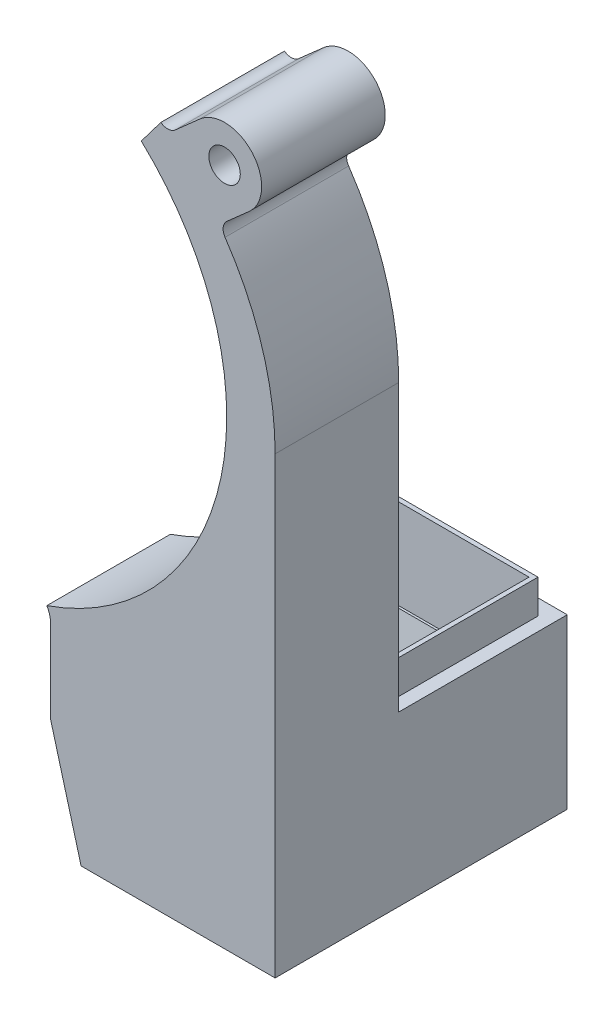
ISO-10303-21;
HEADER;
FILE_DESCRIPTION(('STEP AP214'),'2;1');
FILE_NAME('part.step','',(''),(''),'','','');
FILE_SCHEMA(('AUTOMOTIVE_DESIGN { 1 0 10303 214 1 1 1 1 }'));
ENDSEC;
DATA;
#1=APPLICATION_CONTEXT('core data for automotive mechanical design processes');
#2=APPLICATION_PROTOCOL_DEFINITION('international standard','automotive_design',2000,#1);
#3=PRODUCT_CONTEXT('',#1,'mechanical');
#4=PRODUCT('Part','Part','',(#3));
#5=PRODUCT_RELATED_PRODUCT_CATEGORY('part','',(#4));
#6=PRODUCT_DEFINITION_FORMATION('','',#4);
#7=PRODUCT_DEFINITION_CONTEXT('part definition',#1,'design');
#8=PRODUCT_DEFINITION('design','',#6,#7);
#9=PRODUCT_DEFINITION_SHAPE('','',#8);
#10=(LENGTH_UNIT() NAMED_UNIT(*) SI_UNIT(.MILLI.,.METRE.));
#11=(NAMED_UNIT(*) PLANE_ANGLE_UNIT() SI_UNIT($,.RADIAN.));
#12=(NAMED_UNIT(*) SI_UNIT($,.STERADIAN.) SOLID_ANGLE_UNIT());
#13=UNCERTAINTY_MEASURE_WITH_UNIT(LENGTH_MEASURE(1.E-05),#10,'distance_accuracy_value','');
#14=(GEOMETRIC_REPRESENTATION_CONTEXT(3) GLOBAL_UNCERTAINTY_ASSIGNED_CONTEXT((#13)) GLOBAL_UNIT_ASSIGNED_CONTEXT((#10,
#11,#12)) REPRESENTATION_CONTEXT('',''));
#15=CARTESIAN_POINT('',(0.,0.,0.));
#16=DIRECTION('',(0.,0.,1.));
#17=DIRECTION('',(1.,0.,0.));
#18=AXIS2_PLACEMENT_3D('',#15,#16,#17);
#19=CARTESIAN_POINT('',(2.21102133020147E-13,-22.4,0.));
#20=DIRECTION('',(0.,-1.,0.));
#21=DIRECTION('',(1.,0.,0.));
#22=AXIS2_PLACEMENT_3D('',#19,#20,#21);
#23=PLANE('',#22);
#24=DIRECTION('',(-1.,0.,0.));
#25=VECTOR('',#24,1.);
#26=CARTESIAN_POINT('',(2.22465130032725E-13,-22.4,-13.1999999999975));
#27=LINE('',#26,#25);
#28=CARTESIAN_POINT('',(25.9000000525163,-22.3999999999997,-13.1999999999975));
#29=VERTEX_POINT('',#28);
#30=CARTESIAN_POINT('',(9.09999999999595,-22.3999999999999,-13.1999999999975));
#31=VERTEX_POINT('',#30);
#32=EDGE_CURVE('E269',#29,#31,#27,.T.);
#33=ORIENTED_EDGE('',*,*,#32,.F.);
#34=DIRECTION('',(0.,0.,1.));
#35=VECTOR('',#34,1.);
#36=CARTESIAN_POINT('',(25.9000000525163,-22.3999999999997,0.));
#37=LINE('',#36,#35);
#38=CARTESIAN_POINT('',(25.9000000525163,-22.3999999999997,-1.50000000000016));
#39=VERTEX_POINT('',#38);
#40=EDGE_CURVE('E282',#29,#39,#37,.T.);
#41=ORIENTED_EDGE('',*,*,#40,.T.);
#42=DIRECTION('',(-1.,0.,0.));
#43=VECTOR('',#42,1.);
#44=CARTESIAN_POINT('',(2.21276379797324E-13,-22.4,-1.50000000000016));
#45=LINE('',#44,#43);
#46=CARTESIAN_POINT('',(9.09999999999595,-22.3999999999999,-1.50000000000016));
#47=VERTEX_POINT('',#46);
#48=EDGE_CURVE('E279',#39,#47,#45,.T.);
#49=ORIENTED_EDGE('',*,*,#48,.T.);
#50=DIRECTION('',(0.,0.,1.));
#51=VECTOR('',#50,1.);
#52=CARTESIAN_POINT('',(9.09999999999595,-22.3999999999999,0.));
#53=LINE('',#52,#51);
#54=EDGE_CURVE('E276',#31,#47,#53,.T.);
#55=ORIENTED_EDGE('',*,*,#54,.F.);
#56=EDGE_LOOP('',(#33,#41,#49,#55));
#57=FACE_BOUND('',#56,.T.);
#58=DIRECTION('',(0.,0.,-1.));
#59=VECTOR('',#58,1.);
#60=CARTESIAN_POINT('',(8.69999999999595,-22.3999999999999,0.));
#61=LINE('',#60,#59);
#62=CARTESIAN_POINT('',(8.69999999999595,-22.3999999999998,-1.10000000000016));
#63=VERTEX_POINT('',#62);
#64=CARTESIAN_POINT('',(8.69999999999588,-22.3999999999999,-13.5999999999975));
#65=VERTEX_POINT('',#64);
#66=EDGE_CURVE('E68',#63,#65,#61,.T.);
#67=ORIENTED_EDGE('',*,*,#66,.F.);
#68=DIRECTION('',(-1.,0.,0.));
#69=VECTOR('',#68,1.);
#70=CARTESIAN_POINT('',(2.21102133020147E-13,-22.4,-1.10000000000016));
#71=LINE('',#70,#69);
#72=CARTESIAN_POINT('',(26.3000000525163,-22.3999999999997,-1.10000000000016));
#73=VERTEX_POINT('',#72);
#74=EDGE_CURVE('E410',#73,#63,#71,.T.);
#75=ORIENTED_EDGE('',*,*,#74,.F.);
#76=DIRECTION('',(0.,0.,-1.));
#77=VECTOR('',#76,1.);
#78=CARTESIAN_POINT('',(26.3000000525163,-22.3999999999997,0.));
#79=LINE('',#78,#77);
#80=CARTESIAN_POINT('',(26.3000000525163,-22.3999999999998,-13.5999999999975));
#81=VERTEX_POINT('',#80);
#82=EDGE_CURVE('E407',#73,#81,#79,.T.);
#83=ORIENTED_EDGE('',*,*,#82,.T.);
#84=DIRECTION('',(-1.,0.,0.));
#85=VECTOR('',#84,1.);
#86=CARTESIAN_POINT('',(2.21102133020147E-13,-22.4,-13.5999999999975));
#87=LINE('',#86,#85);
#88=EDGE_CURVE('E404',#81,#65,#87,.T.);
#89=ORIENTED_EDGE('',*,*,#88,.T.);
#90=EDGE_LOOP('',(#67,#75,#83,#89));
#91=FACE_BOUND('',#90,.T.);
#92=ADVANCED_FACE('F60',(#57,#91),#23,.F.);
#93=CARTESIAN_POINT('',(1.18085367454597,0.322571485289525,9.00000000000249));
#94=DIRECTION('',(-0.964655807240221,-0.263513137353184,0.));
#95=DIRECTION('',(0.263513137353184,-0.964655807240221,0.));
#96=AXIS2_PLACEMENT_3D('',#93,#94,#95);
#97=PLANE('',#96);
#98=DIRECTION('',(-0.263513137353184,0.964655807240221,0.));
#99=VECTOR('',#98,1.);
#100=CARTESIAN_POINT('',(1.18085367454597,0.322571485289525,9.00000000000249));
#101=LINE('',#100,#99);
#102=CARTESIAN_POINT('',(12.3049587622228,-40.3999999999999,9.00000000000249));
#103=VERTEX_POINT('',#102);
#104=CARTESIAN_POINT('',(9.57327834963016,-30.3999999999999,9.00000000000249));
#105=VERTEX_POINT('',#104);
#106=EDGE_CURVE('E451',#103,#105,#101,.T.);
#107=ORIENTED_EDGE('',*,*,#106,.F.);
#108=DIRECTION('',(0.,0.,-1.));
#109=VECTOR('',#108,1.);
#110=CARTESIAN_POINT('',(12.3049587622228,-40.3999999999999,9.00000000000249));
#111=LINE('',#110,#109);
#112=CARTESIAN_POINT('',(12.3049587622228,-40.3999999999999,-11.2499999999975));
#113=VERTEX_POINT('',#112);
#114=EDGE_CURVE('E505',#103,#113,#111,.T.);
#115=ORIENTED_EDGE('',*,*,#114,.T.);
#116=DIRECTION('',(-0.259836678581565,0.951197209540902,-0.166459511669658));
#117=VECTOR('',#116,1.);
#118=CARTESIAN_POINT('',(17.3392697142688,-58.8293555308979,-8.02486278209034));
#119=LINE('',#118,#117);
#120=CARTESIAN_POINT('',(9.57327834963012,-30.3999999999997,-12.9999999999975));
#121=VERTEX_POINT('',#120);
#122=EDGE_CURVE('E443',#113,#121,#119,.T.);
#123=ORIENTED_EDGE('',*,*,#122,.T.);
#124=DIRECTION('',(0.,0.,-1.));
#125=VECTOR('',#124,1.);
#126=CARTESIAN_POINT('',(9.57327834963016,-30.3999999999999,9.00000000000249));
#127=LINE('',#126,#125);
#128=CARTESIAN_POINT('',(9.57327834963016,-30.3999999999999,-1.50000000000016));
#129=VERTEX_POINT('',#128);
#130=EDGE_CURVE('E453',#129,#121,#127,.T.);
#131=ORIENTED_EDGE('',*,*,#130,.F.);
#132=EDGE_CURVE('E454',#105,#129,#127,.T.);
#133=ORIENTED_EDGE('',*,*,#132,.F.);
#134=EDGE_LOOP('',(#107,#115,#123,#131,#133));
#135=FACE_BOUND('',#134,.T.);
#136=ADVANCED_FACE('F472',(#135),#97,.F.);
#137=CARTESIAN_POINT('',(25.5000000000006,0.,9.00000000000249));
#138=DIRECTION('',(-1.,0.,0.));
#139=DIRECTION('',(0.,0.,1.));
#140=AXIS2_PLACEMENT_3D('',#137,#138,#139);
#141=PLANE('',#140);
#142=DIRECTION('',(0.,0.,-1.));
#143=VECTOR('',#142,1.);
#144=CARTESIAN_POINT('',(25.5000000000006,-40.3999999999999,9.00000000000249));
#145=LINE('',#144,#143);
#146=CARTESIAN_POINT('',(25.5000000000006,-40.3999999999999,9.00000000000249));
#147=VERTEX_POINT('',#146);
#148=CARTESIAN_POINT('',(25.5000000000006,-40.3999999999999,-11.2499999999975));
#149=VERTEX_POINT('',#148);
#150=EDGE_CURVE('E83',#147,#149,#145,.T.);
#151=ORIENTED_EDGE('',*,*,#150,.F.);
#152=DIRECTION('',(0.,1.,0.));
#153=VECTOR('',#152,1.);
#154=CARTESIAN_POINT('',(25.5000000000006,0.,9.00000000000249));
#155=LINE('',#154,#153);
#156=CARTESIAN_POINT('',(25.5000000000006,-30.3999999999997,9.00000000000249));
#157=VERTEX_POINT('',#156);
#158=EDGE_CURVE('E445',#147,#157,#155,.T.);
#159=ORIENTED_EDGE('',*,*,#158,.T.);
#160=DIRECTION('',(0.,0.,-1.));
#161=VECTOR('',#160,1.);
#162=CARTESIAN_POINT('',(25.5000000000006,-30.3999999999997,9.00000000000249));
#163=LINE('',#162,#161);
#164=CARTESIAN_POINT('',(25.5000000000006,-30.3999999999997,-1.50000000000016));
#165=VERTEX_POINT('',#164);
#166=EDGE_CURVE('E448',#157,#165,#163,.T.);
#167=ORIENTED_EDGE('',*,*,#166,.T.);
#168=CARTESIAN_POINT('',(25.5000000000006,-30.3999999999997,-12.9999999999975));
#169=VERTEX_POINT('',#168);
#170=EDGE_CURVE('E447',#165,#169,#163,.T.);
#171=ORIENTED_EDGE('',*,*,#170,.T.);
#172=DIRECTION('',(0.,0.985030467155704,-0.172380331752248));
#173=VECTOR('',#172,1.);
#174=CARTESIAN_POINT('',(25.5000000000006,-70.3999999999997,-5.99999999999751));
#175=LINE('',#174,#173);
#176=EDGE_CURVE('E441',#149,#169,#175,.T.);
#177=ORIENTED_EDGE('',*,*,#176,.F.);
#178=EDGE_LOOP('',(#151,#159,#167,#171,#177));
#179=FACE_BOUND('',#178,.T.);
#180=ADVANCED_FACE('F502',(#179),#141,.T.);
#181=CARTESIAN_POINT('',(3.00150012373459E-13,-30.4,0.));
#182=DIRECTION('',(0.,-1.,0.));
#183=DIRECTION('',(1.,0.,0.));
#184=AXIS2_PLACEMENT_3D('',#181,#182,#183);
#185=PLANE('',#184);
#186=ORIENTED_EDGE('',*,*,#166,.F.);
#187=DIRECTION('',(-1.,0.,0.));
#188=VECTOR('',#187,1.);
#189=CARTESIAN_POINT('',(3.00104357025206E-13,-30.4,9.00000000000249));
#190=LINE('',#189,#188);
#191=EDGE_CURVE('E271',#157,#105,#190,.T.);
#192=ORIENTED_EDGE('',*,*,#191,.T.);
#193=ORIENTED_EDGE('',*,*,#132,.T.);
#194=DIRECTION('',(-1.,0.,0.));
#195=VECTOR('',#194,1.);
#196=CARTESIAN_POINT('',(3.00324259150635E-13,-30.4,-1.50000000000016));
#197=LINE('',#196,#195);
#198=EDGE_CURVE('E293',#165,#129,#197,.T.);
#199=ORIENTED_EDGE('',*,*,#198,.F.);
#200=EDGE_LOOP('',(#186,#192,#193,#199));
#201=FACE_BOUND('',#200,.T.);
#202=ADVANCED_FACE('F465',(#201),#185,.T.);
#203=CARTESIAN_POINT('',(0.,0.,9.00000000000249));
#204=DIRECTION('',(0.,0.,1.));
#205=DIRECTION('',(1.,0.,0.));
#206=AXIS2_PLACEMENT_3D('',#203,#204,#205);
#207=PLANE('',#206);
#208=ORIENTED_EDGE('',*,*,#158,.F.);
#209=DIRECTION('',(-1.,0.,0.));
#210=VECTOR('',#209,1.);
#211=CARTESIAN_POINT('',(0.,-40.3999999999999,9.00000000000249));
#212=LINE('',#211,#210);
#213=EDGE_CURVE('E251',#147,#103,#212,.T.);
#214=ORIENTED_EDGE('',*,*,#213,.T.);
#215=ORIENTED_EDGE('',*,*,#106,.T.);
#216=ORIENTED_EDGE('',*,*,#191,.F.);
#217=EDGE_LOOP('',(#208,#214,#215,#216));
#218=FACE_BOUND('',#217,.T.);
#219=ADVANCED_FACE('F504',(#218),#207,.F.);
#220=CARTESIAN_POINT('',(27.5,2.77965533355339E-13,11.));
#221=DIRECTION('',(-1.,0.,0.));
#222=DIRECTION('',(0.,-1.,0.));
#223=AXIS2_PLACEMENT_3D('',#220,#221,#222);
#224=PLANE('',#223);
#225=DIRECTION('',(0.,1.,0.));
#226=VECTOR('',#225,1.);
#227=CARTESIAN_POINT('',(27.5,2.77965533355339E-13,11.));
#228=LINE('',#227,#226);
#229=CARTESIAN_POINT('',(27.5000054997072,-40.3999999999999,11.));
#230=VERTEX_POINT('',#229);
#231=CARTESIAN_POINT('',(27.5,2.84279978688662E-13,11.));
#232=VERTEX_POINT('',#231);
#233=EDGE_CURVE('E319',#230,#232,#228,.T.);
#234=ORIENTED_EDGE('',*,*,#233,.F.);
#235=DIRECTION('',(0.,0.,-1.));
#236=VECTOR('',#235,1.);
#237=CARTESIAN_POINT('',(27.5000000000004,-40.3999999999999,11.));
#238=LINE('',#237,#236);
#239=CARTESIAN_POINT('',(27.5000000000006,-40.3999999999999,-14.9999999999975));
#240=VERTEX_POINT('',#239);
#241=EDGE_CURVE('E250',#230,#240,#238,.T.);
#242=ORIENTED_EDGE('',*,*,#241,.T.);
#243=DIRECTION('',(0.,1.,0.));
#244=VECTOR('',#243,1.);
#245=CARTESIAN_POINT('',(27.5000000000004,-30.3999999999997,-14.9999999999975));
#246=LINE('',#245,#244);
#247=CARTESIAN_POINT('',(27.5000000000003,-25.3999999999997,-14.9999999999975));
#248=VERTEX_POINT('',#247);
#249=EDGE_CURVE('E260',#240,#248,#246,.T.);
#250=ORIENTED_EDGE('',*,*,#249,.T.);
#251=DIRECTION('',(0.,0.,1.));
#252=VECTOR('',#251,1.);
#253=CARTESIAN_POINT('',(27.5000000000003,-25.3999999999997,0.));
#254=LINE('',#253,#252);
#255=CARTESIAN_POINT('',(27.5000000000003,-25.3999999999997,0.));
#256=VERTEX_POINT('',#255);
#257=EDGE_CURVE('E288',#248,#256,#254,.T.);
#258=ORIENTED_EDGE('',*,*,#257,.T.);
#259=DIRECTION('',(0.,1.,0.));
#260=VECTOR('',#259,1.);
#261=CARTESIAN_POINT('',(27.5,2.77965533355339E-13,0.));
#262=LINE('',#261,#260);
#263=CARTESIAN_POINT('',(27.5,2.84279978688662E-13,0.));
#264=VERTEX_POINT('',#263);
#265=EDGE_CURVE('E349',#256,#264,#262,.T.);
#266=ORIENTED_EDGE('',*,*,#265,.T.);
#267=DIRECTION('',(0.,0.,-1.));
#268=VECTOR('',#267,1.);
#269=CARTESIAN_POINT('',(27.5,2.84279978688662E-13,11.));
#270=LINE('',#269,#268);
#271=EDGE_CURVE('E401',#232,#264,#270,.T.);
#272=ORIENTED_EDGE('',*,*,#271,.F.);
#273=EDGE_LOOP('',(#234,#242,#250,#258,#266,#272));
#274=FACE_BOUND('',#273,.T.);
#275=ADVANCED_FACE('F550',(#274),#224,.F.);
#276=CARTESIAN_POINT('',(1.85000000000011,0.0167968750000545,11.));
#277=DIRECTION('',(0.,0.,-1.));
#278=DIRECTION('',(-1.,0.,0.));
#279=AXIS2_PLACEMENT_3D('',#276,#277,#278);
#280=CYLINDRICAL_SURFACE('',#279,25.6500054997071);
#281=CARTESIAN_POINT('',(1.85000000000011,0.0167968750000545,0.));
#282=DIRECTION('',(0.,0.,1.));
#283=DIRECTION('',(1.,0.,0.));
#284=AXIS2_PLACEMENT_3D('',#281,#282,#283);
#285=CIRCLE('',#284,25.6500054997071);
#286=CARTESIAN_POINT('',(23.042847290191,14.4662261325746,0.));
#287=VERTEX_POINT('',#286);
#288=EDGE_CURVE('E352',#264,#287,#285,.T.);
#289=ORIENTED_EDGE('',*,*,#288,.T.);
#290=DIRECTION('',(0.,0.,-1.));
#291=VECTOR('',#290,1.);
#292=CARTESIAN_POINT('',(23.042847290191,14.4662261325746,11.));
#293=LINE('',#292,#291);
#294=CARTESIAN_POINT('',(23.042847290191,14.4662261325746,11.));
#295=VERTEX_POINT('',#294);
#296=EDGE_CURVE('E399',#295,#287,#293,.T.);
#297=ORIENTED_EDGE('',*,*,#296,.F.);
#298=CARTESIAN_POINT('',(1.85000000000011,0.0167968750000545,11.));
#299=DIRECTION('',(0.,0.,1.));
#300=DIRECTION('',(1.,0.,0.));
#301=AXIS2_PLACEMENT_3D('',#298,#299,#300);
#302=CIRCLE('',#301,25.6500054997071);
#303=EDGE_CURVE('E322',#232,#295,#302,.T.);
#304=ORIENTED_EDGE('',*,*,#303,.F.);
#305=ORIENTED_EDGE('',*,*,#271,.T.);
#306=EDGE_LOOP('',(#289,#297,#304,#305));
#307=FACE_BOUND('',#306,.T.);
#308=ADVANCED_FACE('F610',(#307),#280,.T.);
#309=CARTESIAN_POINT('',(23.8690789762011,15.029556587133,11.));
#310=DIRECTION('',(0.,0.,-1.));
#311=DIRECTION('',(-1.,0.,0.));
#312=AXIS2_PLACEMENT_3D('',#309,#310,#311);
#313=CYLINDRICAL_SURFACE('',#312,1.00000000000001);
#314=CARTESIAN_POINT('',(23.8690789762011,15.029556587133,0.));
#315=DIRECTION('',(0.,0.,1.));
#316=DIRECTION('',(1.,0.,0.));
#317=AXIS2_PLACEMENT_3D('',#314,#315,#316);
#318=CIRCLE('',#317,1.00000000000001);
#319=CARTESIAN_POINT('',(23.2068811797294,15.7788856726141,0.));
#320=VERTEX_POINT('',#319);
#321=EDGE_CURVE('E355',#320,#287,#318,.T.);
#322=ORIENTED_EDGE('',*,*,#321,.F.);
#323=DIRECTION('',(0.,0.,-1.));
#324=VECTOR('',#323,1.);
#325=CARTESIAN_POINT('',(23.2068811797294,15.7788856726141,11.));
#326=LINE('',#325,#324);
#327=CARTESIAN_POINT('',(23.2068811797294,15.7788856726141,11.));
#328=VERTEX_POINT('',#327);
#329=EDGE_CURVE('E397',#328,#320,#326,.T.);
#330=ORIENTED_EDGE('',*,*,#329,.F.);
#331=CARTESIAN_POINT('',(23.8690789762011,15.029556587133,11.));
#332=DIRECTION('',(0.,0.,1.));
#333=DIRECTION('',(1.,0.,0.));
#334=AXIS2_PLACEMENT_3D('',#331,#332,#333);
#335=CIRCLE('',#334,1.00000000000001);
#336=EDGE_CURVE('E324',#328,#295,#335,.T.);
#337=ORIENTED_EDGE('',*,*,#336,.T.);
#338=ORIENTED_EDGE('',*,*,#296,.T.);
#339=EDGE_LOOP('',(#322,#330,#337,#338));
#340=FACE_BOUND('',#339,.T.);
#341=ADVANCED_FACE('F606',(#340),#313,.F.);
#342=CARTESIAN_POINT('',(2.34680754159689,-2.65559800759642,11.));
#343=DIRECTION('',(0.662197796471719,-0.749329085481139,0.));
#344=DIRECTION('',(0.749329085481139,0.662197796471719,0.));
#345=AXIS2_PLACEMENT_3D('',#342,#343,#344);
#346=PLANE('',#345);
#347=DIRECTION('',(-0.749329085481139,-0.662197796471719,0.));
#348=VECTOR('',#347,1.);
#349=CARTESIAN_POINT('',(2.34680754159689,-2.65559800759642,0.));
#350=LINE('',#349,#348);
#351=CARTESIAN_POINT('',(25.1852527283565,17.5272140179125,0.));
#352=VERTEX_POINT('',#351);
#353=EDGE_CURVE('E358',#352,#320,#350,.T.);
#354=ORIENTED_EDGE('',*,*,#353,.F.);
#355=DIRECTION('',(0.,0.,-1.));
#356=VECTOR('',#355,1.);
#357=CARTESIAN_POINT('',(25.1852527283565,17.5272140179125,11.));
#358=LINE('',#357,#356);
#359=CARTESIAN_POINT('',(25.1852527283565,17.5272140179125,11.));
#360=VERTEX_POINT('',#359);
#361=EDGE_CURVE('E395',#360,#352,#358,.T.);
#362=ORIENTED_EDGE('',*,*,#361,.F.);
#363=DIRECTION('',(-0.749329085481139,-0.662197796471719,0.));
#364=VECTOR('',#363,1.);
#365=CARTESIAN_POINT('',(2.34680754159689,-2.65559800759642,11.));
#366=LINE('',#365,#364);
#367=EDGE_CURVE('E327',#360,#328,#366,.T.);
#368=ORIENTED_EDGE('',*,*,#367,.T.);
#369=ORIENTED_EDGE('',*,*,#329,.T.);
#370=EDGE_LOOP('',(#354,#362,#368,#369));
#371=FACE_BOUND('',#370,.T.);
#372=ADVANCED_FACE('F602',(#371),#346,.T.);
#373=CARTESIAN_POINT('',(22.9999999999998,20.0000000000002,11.));
#374=DIRECTION('',(0.,0.,-1.));
#375=DIRECTION('',(-1.,0.,0.));
#376=AXIS2_PLACEMENT_3D('',#373,#374,#375);
#377=CYLINDRICAL_SURFACE('',#376,3.3);
#378=CARTESIAN_POINT('',(22.9999999999998,20.0000000000002,0.));
#379=DIRECTION('',(0.,0.,1.));
#380=DIRECTION('',(1.,0.,0.));
#381=AXIS2_PLACEMENT_3D('',#378,#379,#380);
#382=CIRCLE('',#381,3.3);
#383=CARTESIAN_POINT('',(20.8147472716431,22.472785982088,0.));
#384=VERTEX_POINT('',#383);
#385=EDGE_CURVE('E361',#352,#384,#382,.T.);
#386=ORIENTED_EDGE('',*,*,#385,.T.);
#387=DIRECTION('',(0.,0.,-1.));
#388=VECTOR('',#387,1.);
#389=CARTESIAN_POINT('',(20.8147472716431,22.472785982088,11.));
#390=LINE('',#389,#388);
#391=CARTESIAN_POINT('',(20.8147472716431,22.472785982088,11.));
#392=VERTEX_POINT('',#391);
#393=EDGE_CURVE('E392',#392,#384,#390,.T.);
#394=ORIENTED_EDGE('',*,*,#393,.F.);
#395=CARTESIAN_POINT('',(22.9999999999998,20.0000000000002,11.));
#396=DIRECTION('',(0.,0.,1.));
#397=DIRECTION('',(1.,0.,0.));
#398=AXIS2_PLACEMENT_3D('',#395,#396,#397);
#399=CIRCLE('',#398,3.3);
#400=EDGE_CURVE('E330',#360,#392,#399,.T.);
#401=ORIENTED_EDGE('',*,*,#400,.F.);
#402=ORIENTED_EDGE('',*,*,#361,.T.);
#403=EDGE_LOOP('',(#386,#394,#401,#402));
#404=FACE_BOUND('',#403,.T.);
#405=ADVANCED_FACE('F598',(#404),#377,.T.);
#406=CARTESIAN_POINT('',(-2.02369791511646,2.28997395657911,11.));
#407=DIRECTION('',(0.662197796471718,-0.74932908548114,0.));
#408=DIRECTION('',(0.74932908548114,0.662197796471718,0.));
#409=AXIS2_PLACEMENT_3D('',#406,#407,#408);
#410=PLANE('',#409);
#411=DIRECTION('',(-0.74932908548114,-0.662197796471718,0.));
#412=VECTOR('',#411,1.);
#413=CARTESIAN_POINT('',(-2.02369791511646,2.28997395657911,0.));
#414=LINE('',#413,#412);
#415=CARTESIAN_POINT('',(18.5989053771655,20.5146001218519,0.));
#416=VERTEX_POINT('',#415);
#417=EDGE_CURVE('E363',#384,#416,#414,.T.);
#418=ORIENTED_EDGE('',*,*,#417,.T.);
#419=DIRECTION('',(0.,0.,-1.));
#420=VECTOR('',#419,1.);
#421=CARTESIAN_POINT('',(18.5989053771655,20.5146001218519,11.));
#422=LINE('',#421,#420);
#423=CARTESIAN_POINT('',(18.5989053771655,20.5146001218519,11.));
#424=VERTEX_POINT('',#423);
#425=EDGE_CURVE('E389',#424,#416,#422,.T.);
#426=ORIENTED_EDGE('',*,*,#425,.F.);
#427=DIRECTION('',(-0.74932908548114,-0.662197796471718,0.));
#428=VECTOR('',#427,1.);
#429=CARTESIAN_POINT('',(-2.02369791511646,2.28997395657911,11.));
#430=LINE('',#429,#428);
#431=EDGE_CURVE('E332',#392,#424,#430,.T.);
#432=ORIENTED_EDGE('',*,*,#431,.F.);
#433=ORIENTED_EDGE('',*,*,#393,.T.);
#434=EDGE_LOOP('',(#418,#426,#432,#433));
#435=FACE_BOUND('',#434,.T.);
#436=ADVANCED_FACE('F594',(#435),#410,.F.);
#437=CARTESIAN_POINT('',(17.9367075806938,21.2639292073331,11.));
#438=DIRECTION('',(0.,0.,-1.));
#439=DIRECTION('',(-1.,0.,0.));
#440=AXIS2_PLACEMENT_3D('',#437,#438,#439);
#441=CYLINDRICAL_SURFACE('',#440,1.00000000000001);
#442=CARTESIAN_POINT('',(17.9367075806938,21.2639292073331,0.));
#443=DIRECTION('',(0.,0.,1.));
#444=DIRECTION('',(1.,0.,0.));
#445=AXIS2_PLACEMENT_3D('',#442,#443,#444);
#446=CIRCLE('',#445,1.00000000000001);
#447=CARTESIAN_POINT('',(17.333078902986,20.4666636183047,0.));
#448=VERTEX_POINT('',#447);
#449=EDGE_CURVE('E365',#416,#448,#446,.F.);
#450=ORIENTED_EDGE('',*,*,#449,.T.);
#451=DIRECTION('',(0.,0.,-1.));
#452=VECTOR('',#451,1.);
#453=CARTESIAN_POINT('',(17.333078902986,20.4666636183047,11.));
#454=LINE('',#453,#452);
#455=CARTESIAN_POINT('',(17.333078902986,20.4666636183047,11.));
#456=VERTEX_POINT('',#455);
#457=EDGE_CURVE('E386',#456,#448,#454,.T.);
#458=ORIENTED_EDGE('',*,*,#457,.F.);
#459=CARTESIAN_POINT('',(17.9367075806938,21.2639292073331,11.));
#460=DIRECTION('',(0.,0.,1.));
#461=DIRECTION('',(1.,0.,0.));
#462=AXIS2_PLACEMENT_3D('',#459,#460,#461);
#463=CIRCLE('',#462,1.00000000000001);
#464=EDGE_CURVE('E334',#424,#456,#463,.F.);
#465=ORIENTED_EDGE('',*,*,#464,.F.);
#466=ORIENTED_EDGE('',*,*,#425,.T.);
#467=EDGE_LOOP('',(#450,#458,#465,#466));
#468=FACE_BOUND('',#467,.T.);
#469=ADVANCED_FACE('F590',(#468),#441,.F.);
#470=CARTESIAN_POINT('',(1.16783644002256,-0.884196653876564,11.));
#471=DIRECTION('',(0.797265589028358,-0.603628677707799,0.));
#472=DIRECTION('',(0.603628677707799,0.797265589028358,0.));
#473=AXIS2_PLACEMENT_3D('',#470,#471,#472);
#474=PLANE('',#473);
#475=DIRECTION('',(-0.603628677707799,-0.797265589028358,0.));
#476=VECTOR('',#475,1.);
#477=CARTESIAN_POINT('',(1.16783644002256,-0.884196653876564,0.));
#478=LINE('',#477,#476);
#479=CARTESIAN_POINT('',(15.5862000144247,18.1594067276303,0.));
#480=VERTEX_POINT('',#479);
#481=EDGE_CURVE('E367',#448,#480,#478,.T.);
#482=ORIENTED_EDGE('',*,*,#481,.T.);
#483=DIRECTION('',(0.,0.,-1.));
#484=VECTOR('',#483,1.);
#485=CARTESIAN_POINT('',(15.5862000144247,18.1594067276303,11.));
#486=LINE('',#485,#484);
#487=CARTESIAN_POINT('',(15.5862000144247,18.1594067276303,11.));
#488=VERTEX_POINT('',#487);
#489=EDGE_CURVE('E383',#488,#480,#486,.T.);
#490=ORIENTED_EDGE('',*,*,#489,.F.);
#491=DIRECTION('',(-0.603628677707799,-0.797265589028358,0.));
#492=VECTOR('',#491,1.);
#493=CARTESIAN_POINT('',(1.16783644002256,-0.884196653876564,11.));
#494=LINE('',#493,#492);
#495=EDGE_CURVE('E336',#456,#488,#494,.T.);
#496=ORIENTED_EDGE('',*,*,#495,.F.);
#497=ORIENTED_EDGE('',*,*,#457,.T.);
#498=EDGE_LOOP('',(#482,#490,#496,#497));
#499=FACE_BOUND('',#498,.T.);
#500=ADVANCED_FACE('F586',(#499),#474,.F.);
#501=CARTESIAN_POINT('',(-0.684887777715923,0.68488777771591,11.));
#502=DIRECTION('',(0.,0.,-1.));
#503=DIRECTION('',(-1.,0.,0.));
#504=AXIS2_PLACEMENT_3D('',#501,#502,#503);
#505=CYLINDRICAL_SURFACE('',#504,23.8769158492144);
#506=CARTESIAN_POINT('',(-0.684887777715923,0.68488777771591,0.));
#507=DIRECTION('',(0.,0.,1.));
#508=DIRECTION('',(1.,0.,0.));
#509=AXIS2_PLACEMENT_3D('',#506,#507,#508);
#510=CIRCLE('',#509,23.8769158492144);
#511=CARTESIAN_POINT('',(7.17409382346962,-21.8615868616305,0.));
#512=VERTEX_POINT('',#511);
#513=EDGE_CURVE('E369',#480,#512,#510,.F.);
#514=ORIENTED_EDGE('',*,*,#513,.T.);
#515=DIRECTION('',(0.,0.,-1.));
#516=VECTOR('',#515,1.);
#517=CARTESIAN_POINT('',(7.17409382346962,-21.8615868616305,11.));
#518=LINE('',#517,#516);
#519=CARTESIAN_POINT('',(7.17409382346962,-21.8615868616305,11.));
#520=VERTEX_POINT('',#519);
#521=EDGE_CURVE('E381',#520,#512,#518,.T.);
#522=ORIENTED_EDGE('',*,*,#521,.F.);
#523=CARTESIAN_POINT('',(-0.684887777715923,0.68488777771591,11.));
#524=DIRECTION('',(0.,0.,1.));
#525=DIRECTION('',(1.,0.,0.));
#526=AXIS2_PLACEMENT_3D('',#523,#524,#525);
#527=CIRCLE('',#526,23.8769158492144);
#528=EDGE_CURVE('E338',#488,#520,#527,.F.);
#529=ORIENTED_EDGE('',*,*,#528,.F.);
#530=ORIENTED_EDGE('',*,*,#489,.T.);
#531=EDGE_LOOP('',(#514,#522,#529,#530));
#532=FACE_BOUND('',#531,.T.);
#533=ADVANCED_FACE('F582',(#532),#505,.F.);
#534=CARTESIAN_POINT('',(5.50000000000022,-22.9558491109207,11.));
#535=DIRECTION('',(0.,0.,-1.));
#536=DIRECTION('',(-1.,0.,0.));
#537=AXIS2_PLACEMENT_3D('',#534,#535,#536);
#538=CYLINDRICAL_SURFACE('',#537,2.);
#539=CARTESIAN_POINT('',(5.50000000000022,-22.9558491109207,0.));
#540=DIRECTION('',(0.,0.,1.));
#541=DIRECTION('',(1.,0.,0.));
#542=AXIS2_PLACEMENT_3D('',#539,#540,#541);
#543=CIRCLE('',#542,2.);
#544=CARTESIAN_POINT('',(7.50000000000023,-22.9558491109207,0.));
#545=VERTEX_POINT('',#544);
#546=EDGE_CURVE('E372',#545,#512,#543,.T.);
#547=ORIENTED_EDGE('',*,*,#546,.F.);
#548=DIRECTION('',(0.,0.,-1.));
#549=VECTOR('',#548,1.);
#550=CARTESIAN_POINT('',(7.50000000000023,-22.9558491109207,11.));
#551=LINE('',#550,#549);
#552=CARTESIAN_POINT('',(7.50000000000023,-22.9558491109207,11.));
#553=VERTEX_POINT('',#552);
#554=EDGE_CURVE('E346',#553,#545,#551,.T.);
#555=ORIENTED_EDGE('',*,*,#554,.F.);
#556=CARTESIAN_POINT('',(5.50000000000022,-22.9558491109207,11.));
#557=DIRECTION('',(0.,0.,1.));
#558=DIRECTION('',(1.,0.,0.));
#559=AXIS2_PLACEMENT_3D('',#556,#557,#558);
#560=CIRCLE('',#559,2.);
#561=EDGE_CURVE('E340',#553,#520,#560,.T.);
#562=ORIENTED_EDGE('',*,*,#561,.T.);
#563=ORIENTED_EDGE('',*,*,#521,.T.);
#564=EDGE_LOOP('',(#547,#555,#562,#563));
#565=FACE_BOUND('',#564,.T.);
#566=ADVANCED_FACE('F578',(#565),#538,.F.);
#567=CARTESIAN_POINT('',(7.49999999999999,0.,11.));
#568=DIRECTION('',(-1.,0.,0.));
#569=DIRECTION('',(0.,-1.,0.));
#570=AXIS2_PLACEMENT_3D('',#567,#568,#569);
#571=PLANE('',#570);
#572=DIRECTION('',(0.,1.,0.));
#573=VECTOR('',#572,1.);
#574=CARTESIAN_POINT('',(7.49999999999999,0.,0.));
#575=LINE('',#574,#573);
#576=CARTESIAN_POINT('',(7.50000000000025,-25.3999999999999,0.));
#577=VERTEX_POINT('',#576);
#578=EDGE_CURVE('E375',#577,#545,#575,.T.);
#579=ORIENTED_EDGE('',*,*,#578,.F.);
#580=DIRECTION('',(0.,0.,-1.));
#581=VECTOR('',#580,1.);
#582=CARTESIAN_POINT('',(7.50000000000025,-25.3999999999999,0.));
#583=LINE('',#582,#581);
#584=CARTESIAN_POINT('',(7.49999999999598,-25.3999999999999,-14.9999999999975));
#585=VERTEX_POINT('',#584);
#586=EDGE_CURVE('E285',#577,#585,#583,.T.);
#587=ORIENTED_EDGE('',*,*,#586,.T.);
#588=DIRECTION('',(0.,1.,0.));
#589=VECTOR('',#588,1.);
#590=CARTESIAN_POINT('',(7.49999999999603,-30.3999999999999,-14.9999999999975));
#591=LINE('',#590,#589);
#592=CARTESIAN_POINT('',(7.49999999999603,-30.3999999999999,-14.9999999999975));
#593=VERTEX_POINT('',#592);
#594=EDGE_CURVE('E307',#593,#585,#591,.T.);
#595=ORIENTED_EDGE('',*,*,#594,.F.);
#596=DIRECTION('',(0.,0.,-1.));
#597=VECTOR('',#596,1.);
#598=CARTESIAN_POINT('',(7.5000000000003,-30.3999999999999,0.));
#599=LINE('',#598,#597);
#600=CARTESIAN_POINT('',(7.49999999999611,-30.3999999999999,11.));
#601=VERTEX_POINT('',#600);
#602=EDGE_CURVE('E263',#601,#593,#599,.T.);
#603=ORIENTED_EDGE('',*,*,#602,.F.);
#604=DIRECTION('',(0.,1.,0.));
#605=VECTOR('',#604,1.);
#606=CARTESIAN_POINT('',(7.49999999999999,0.,11.));
#607=LINE('',#606,#605);
#608=EDGE_CURVE('E343',#601,#553,#607,.T.);
#609=ORIENTED_EDGE('',*,*,#608,.T.);
#610=ORIENTED_EDGE('',*,*,#554,.T.);
#611=EDGE_LOOP('',(#579,#587,#595,#603,#609,#610));
#612=FACE_BOUND('',#611,.T.);
#613=ADVANCED_FACE('F575',(#612),#571,.T.);
#614=CARTESIAN_POINT('',(22.9999999999998,20.0000000000002,11.));
#615=DIRECTION('',(0.,0.,-1.));
#616=DIRECTION('',(-1.,0.,0.));
#617=AXIS2_PLACEMENT_3D('',#614,#615,#616);
#618=CYLINDRICAL_SURFACE('',#617,1.4);
#619=CARTESIAN_POINT('',(22.9999999999998,20.0000000000002,11.));
#620=DIRECTION('',(0.,0.,1.));
#621=DIRECTION('',(1.,0.,0.));
#622=AXIS2_PLACEMENT_3D('',#619,#620,#621);
#623=CIRCLE('',#622,1.4);
#624=CARTESIAN_POINT('',(24.3999999999998,20.0000000000002,11.));
#625=VERTEX_POINT('',#624);
#626=EDGE_CURVE('E316',#625,#625,#623,.T.);
#627=ORIENTED_EDGE('',*,*,#626,.T.);
#628=EDGE_LOOP('',(#627));
#629=FACE_BOUND('',#628,.T.);
#630=CARTESIAN_POINT('',(22.9999999999998,20.0000000000002,0.));
#631=DIRECTION('',(0.,0.,1.));
#632=DIRECTION('',(1.,0.,0.));
#633=AXIS2_PLACEMENT_3D('',#630,#631,#632);
#634=CIRCLE('',#633,1.4);
#635=CARTESIAN_POINT('',(24.3999999999998,20.0000000000002,0.));
#636=VERTEX_POINT('',#635);
#637=EDGE_CURVE('E313',#636,#636,#634,.T.);
#638=ORIENTED_EDGE('',*,*,#637,.F.);
#639=EDGE_LOOP('',(#638));
#640=FACE_BOUND('',#639,.T.);
#641=ADVANCED_FACE('F62',(#629,#640),#618,.F.);
#642=CARTESIAN_POINT('',(0.,0.,11.));
#643=DIRECTION('',(0.,0.,1.));
#644=DIRECTION('',(1.,0.,0.));
#645=AXIS2_PLACEMENT_3D('',#642,#643,#644);
#646=PLANE('',#645);
#647=DIRECTION('',(1.,0.,0.));
#648=VECTOR('',#647,1.);
#649=CARTESIAN_POINT('',(0.,-40.3999999999999,11.));
#650=LINE('',#649,#648);
#651=CARTESIAN_POINT('',(10.2316804125886,-40.3999999999999,11.));
#652=VERTEX_POINT('',#651);
#653=EDGE_CURVE('E75',#652,#230,#650,.T.);
#654=ORIENTED_EDGE('',*,*,#653,.T.);
#655=ORIENTED_EDGE('',*,*,#233,.T.);
#656=ORIENTED_EDGE('',*,*,#303,.T.);
#657=ORIENTED_EDGE('',*,*,#336,.F.);
#658=ORIENTED_EDGE('',*,*,#367,.F.);
#659=ORIENTED_EDGE('',*,*,#400,.T.);
#660=ORIENTED_EDGE('',*,*,#431,.T.);
#661=ORIENTED_EDGE('',*,*,#464,.T.);
#662=ORIENTED_EDGE('',*,*,#495,.T.);
#663=ORIENTED_EDGE('',*,*,#528,.T.);
#664=ORIENTED_EDGE('',*,*,#561,.F.);
#665=ORIENTED_EDGE('',*,*,#608,.F.);
#666=DIRECTION('',(0.263513137353174,-0.964655807240223,0.));
#667=VECTOR('',#666,1.);
#668=CARTESIAN_POINT('',(-0.748457939934082,-0.204454789416728,11.));
#669=LINE('',#668,#667);
#670=EDGE_CURVE('E266',#601,#652,#669,.T.);
#671=ORIENTED_EDGE('',*,*,#670,.T.);
#672=EDGE_LOOP('',(#654,#655,#656,#657,#658,#659,#660,#661,#662,#663,#664,#665,#671));
#673=FACE_BOUND('',#672,.T.);
#674=ORIENTED_EDGE('',*,*,#626,.F.);
#675=EDGE_LOOP('',(#674));
#676=FACE_BOUND('',#675,.T.);
#677=ADVANCED_FACE('F531',(#673,#676),#646,.T.);
#678=CARTESIAN_POINT('',(0.,0.,0.));
#679=DIRECTION('',(0.,0.,1.));
#680=DIRECTION('',(1.,0.,0.));
#681=AXIS2_PLACEMENT_3D('',#678,#679,#680);
#682=PLANE('',#681);
#683=ORIENTED_EDGE('',*,*,#637,.T.);
#684=EDGE_LOOP('',(#683));
#685=FACE_BOUND('',#684,.T.);
#686=ORIENTED_EDGE('',*,*,#265,.F.);
#687=DIRECTION('',(1.,0.,0.));
#688=VECTOR('',#687,1.);
#689=CARTESIAN_POINT('',(2.51153264851922E-13,-25.4,0.));
#690=LINE('',#689,#688);
#691=EDGE_CURVE('E320',#577,#256,#690,.T.);
#692=ORIENTED_EDGE('',*,*,#691,.F.);
#693=ORIENTED_EDGE('',*,*,#578,.T.);
#694=ORIENTED_EDGE('',*,*,#546,.T.);
#695=ORIENTED_EDGE('',*,*,#513,.F.);
#696=ORIENTED_EDGE('',*,*,#481,.F.);
#697=ORIENTED_EDGE('',*,*,#449,.F.);
#698=ORIENTED_EDGE('',*,*,#417,.F.);
#699=ORIENTED_EDGE('',*,*,#385,.F.);
#700=ORIENTED_EDGE('',*,*,#353,.T.);
#701=ORIENTED_EDGE('',*,*,#321,.T.);
#702=ORIENTED_EDGE('',*,*,#288,.F.);
#703=EDGE_LOOP('',(#686,#692,#693,#694,#695,#696,#697,#698,#699,#700,#701,#702));
#704=FACE_BOUND('',#703,.T.);
#705=ADVANCED_FACE('F523',(#685,#704),#682,.F.);
#706=CARTESIAN_POINT('',(2.50745087777639E-13,-25.4,0.));
#707=DIRECTION('',(0.,-1.,0.));
#708=DIRECTION('',(1.,0.,0.));
#709=AXIS2_PLACEMENT_3D('',#706,#707,#708);
#710=PLANE('',#709);
#711=ORIENTED_EDGE('',*,*,#586,.F.);
#712=ORIENTED_EDGE('',*,*,#691,.T.);
#713=ORIENTED_EDGE('',*,*,#257,.F.);
#714=DIRECTION('',(1.,0.,0.));
#715=VECTOR('',#714,1.);
#716=CARTESIAN_POINT('',(2.50745087777639E-13,-25.4,-14.9999999999975));
#717=LINE('',#716,#715);
#718=EDGE_CURVE('E300',#585,#248,#717,.T.);
#719=ORIENTED_EDGE('',*,*,#718,.F.);
#720=EDGE_LOOP('',(#711,#712,#713,#719));
#721=FACE_BOUND('',#720,.T.);
#722=DIRECTION('',(-1.,0.,0.));
#723=VECTOR('',#722,1.);
#724=CARTESIAN_POINT('',(2.50745087777639E-13,-25.4,-13.5999999999975));
#725=LINE('',#724,#723);
#726=CARTESIAN_POINT('',(26.3000000525163,-25.3999999999997,-13.5999999999975));
#727=VERTEX_POINT('',#726);
#728=CARTESIAN_POINT('',(8.69999999999588,-25.3999999999999,-13.5999999999975));
#729=VERTEX_POINT('',#728);
#730=EDGE_CURVE('E513',#727,#729,#725,.T.);
#731=ORIENTED_EDGE('',*,*,#730,.F.);
#732=DIRECTION('',(0.,0.,-1.));
#733=VECTOR('',#732,1.);
#734=CARTESIAN_POINT('',(26.3000000525163,-25.3999999999997,0.));
#735=LINE('',#734,#733);
#736=CARTESIAN_POINT('',(26.3000000525163,-25.3999999999997,-1.10000000000016));
#737=VERTEX_POINT('',#736);
#738=EDGE_CURVE('E433',#737,#727,#735,.T.);
#739=ORIENTED_EDGE('',*,*,#738,.F.);
#740=DIRECTION('',(-1.,0.,0.));
#741=VECTOR('',#740,1.);
#742=CARTESIAN_POINT('',(2.50745087777639E-13,-25.4,-1.10000000000016));
#743=LINE('',#742,#741);
#744=CARTESIAN_POINT('',(8.69999999999598,-25.3999999999999,-1.10000000000016));
#745=VERTEX_POINT('',#744);
#746=EDGE_CURVE('E437',#737,#745,#743,.T.);
#747=ORIENTED_EDGE('',*,*,#746,.T.);
#748=DIRECTION('',(0.,0.,-1.));
#749=VECTOR('',#748,1.);
#750=CARTESIAN_POINT('',(8.69999999999598,-25.3999999999999,0.));
#751=LINE('',#750,#749);
#752=EDGE_CURVE('E511',#745,#729,#751,.T.);
#753=ORIENTED_EDGE('',*,*,#752,.T.);
#754=EDGE_LOOP('',(#731,#739,#747,#753));
#755=FACE_BOUND('',#754,.T.);
#756=ADVANCED_FACE('F521',(#721,#755),#710,.F.);
#757=CARTESIAN_POINT('',(3.01513009386036E-13,-30.4,-13.1999999999975));
#758=DIRECTION('',(0.,0.,-1.));
#759=DIRECTION('',(-1.,0.,0.));
#760=AXIS2_PLACEMENT_3D('',#757,#758,#759);
#761=PLANE('',#760);
#762=DIRECTION('',(0.,1.,0.));
#763=VECTOR('',#762,1.);
#764=CARTESIAN_POINT('',(25.9000000525164,-30.3999999999997,-13.1999999999975));
#765=LINE('',#764,#763);
#766=CARTESIAN_POINT('',(25.9000000525164,-30.3999999999997,-13.1999999999975));
#767=VERTEX_POINT('',#766);
#768=EDGE_CURVE('E304',#767,#29,#765,.T.);
#769=ORIENTED_EDGE('',*,*,#768,.T.);
#770=ORIENTED_EDGE('',*,*,#32,.T.);
#771=DIRECTION('',(0.,1.,0.));
#772=VECTOR('',#771,1.);
#773=CARTESIAN_POINT('',(9.09999999999603,-30.3999999999999,-13.1999999999975));
#774=LINE('',#773,#772);
#775=CARTESIAN_POINT('',(9.09999999999603,-30.3999999999999,-13.1999999999975));
#776=VERTEX_POINT('',#775);
#777=EDGE_CURVE('E311',#776,#31,#774,.T.);
#778=ORIENTED_EDGE('',*,*,#777,.F.);
#779=DIRECTION('',(-1.,0.,0.));
#780=VECTOR('',#779,1.);
#781=CARTESIAN_POINT('',(3.01513009386036E-13,-30.4,-13.1999999999975));
#782=LINE('',#781,#780);
#783=EDGE_CURVE('E287',#767,#776,#782,.T.);
#784=ORIENTED_EDGE('',*,*,#783,.F.);
#785=EDGE_LOOP('',(#769,#770,#778,#784));
#786=FACE_BOUND('',#785,.T.);
#787=ADVANCED_FACE('F492',(#786),#761,.F.);
#788=CARTESIAN_POINT('',(9.09999999999603,-30.3999999999999,0.));
#789=DIRECTION('',(-1.,0.,0.));
#790=DIRECTION('',(0.,-1.,0.));
#791=AXIS2_PLACEMENT_3D('',#788,#789,#790);
#792=PLANE('',#791);
#793=ORIENTED_EDGE('',*,*,#777,.T.);
#794=ORIENTED_EDGE('',*,*,#54,.T.);
#795=DIRECTION('',(0.,1.,0.));
#796=VECTOR('',#795,1.);
#797=CARTESIAN_POINT('',(9.09999999999603,-30.3999999999999,-1.50000000000016));
#798=LINE('',#797,#796);
#799=CARTESIAN_POINT('',(9.09999999999603,-30.3999999999999,-1.50000000000016));
#800=VERTEX_POINT('',#799);
#801=EDGE_CURVE('E309',#800,#47,#798,.T.);
#802=ORIENTED_EDGE('',*,*,#801,.F.);
#803=DIRECTION('',(0.,0.,1.));
#804=VECTOR('',#803,1.);
#805=CARTESIAN_POINT('',(9.09999999999603,-30.3999999999999,0.));
#806=LINE('',#805,#804);
#807=EDGE_CURVE('E291',#776,#800,#806,.T.);
#808=ORIENTED_EDGE('',*,*,#807,.F.);
#809=EDGE_LOOP('',(#793,#794,#802,#808));
#810=FACE_BOUND('',#809,.T.);
#811=ADVANCED_FACE('F486',(#810),#792,.F.);
#812=CARTESIAN_POINT('',(3.00324259150635E-13,-30.4,-1.50000000000016));
#813=DIRECTION('',(0.,0.,-1.));
#814=DIRECTION('',(-1.,0.,0.));
#815=AXIS2_PLACEMENT_3D('',#812,#813,#814);
#816=PLANE('',#815);
#817=ORIENTED_EDGE('',*,*,#801,.T.);
#818=ORIENTED_EDGE('',*,*,#48,.F.);
#819=DIRECTION('',(0.,1.,0.));
#820=VECTOR('',#819,1.);
#821=CARTESIAN_POINT('',(25.9000000525164,-30.3999999999997,-1.50000000000016));
#822=LINE('',#821,#820);
#823=CARTESIAN_POINT('',(25.9000000525164,-30.3999999999997,-1.50000000000016));
#824=VERTEX_POINT('',#823);
#825=EDGE_CURVE('E306',#824,#39,#822,.T.);
#826=ORIENTED_EDGE('',*,*,#825,.F.);
#827=EDGE_CURVE('E294',#824,#165,#197,.T.);
#828=ORIENTED_EDGE('',*,*,#827,.T.);
#829=ORIENTED_EDGE('',*,*,#198,.T.);
#830=DIRECTION('',(-1.,0.,0.));
#831=VECTOR('',#830,1.);
#832=CARTESIAN_POINT('',(3.00324259150635E-13,-30.4,-1.50000000000016));
#833=LINE('',#832,#831);
#834=EDGE_CURVE('E457',#129,#800,#833,.T.);
#835=ORIENTED_EDGE('',*,*,#834,.T.);
#836=EDGE_LOOP('',(#817,#818,#826,#828,#829,#835));
#837=FACE_BOUND('',#836,.T.);
#838=ADVANCED_FACE('F483',(#837),#816,.T.);
#839=CARTESIAN_POINT('',(3.00150012373459E-13,-30.4,-14.9999999999975));
#840=DIRECTION('',(0.,0.,1.));
#841=DIRECTION('',(1.,0.,0.));
#842=AXIS2_PLACEMENT_3D('',#839,#840,#841);
#843=PLANE('',#842);
#844=ORIENTED_EDGE('',*,*,#249,.F.);
#845=DIRECTION('',(1.,0.,0.));
#846=VECTOR('',#845,1.);
#847=CARTESIAN_POINT('',(0.,-40.3999999999999,-14.9999999999975));
#848=LINE('',#847,#846);
#849=CARTESIAN_POINT('',(10.2316804125886,-40.3999999999999,-14.9999999999975));
#850=VERTEX_POINT('',#849);
#851=EDGE_CURVE('E244',#850,#240,#848,.T.);
#852=ORIENTED_EDGE('',*,*,#851,.F.);
#853=DIRECTION('',(0.263513137353174,-0.964655807240223,0.));
#854=VECTOR('',#853,1.);
#855=CARTESIAN_POINT('',(-0.748457939934082,-0.204454789416728,-14.9999999999975));
#856=LINE('',#855,#854);
#857=EDGE_CURVE('E258',#593,#850,#856,.T.);
#858=ORIENTED_EDGE('',*,*,#857,.F.);
#859=ORIENTED_EDGE('',*,*,#594,.T.);
#860=ORIENTED_EDGE('',*,*,#718,.T.);
#861=EDGE_LOOP('',(#844,#852,#858,#859,#860));
#862=FACE_BOUND('',#861,.T.);
#863=ADVANCED_FACE('F256',(#862),#843,.F.);
#864=CARTESIAN_POINT('',(25.9000000525164,-30.3999999999997,0.));
#865=DIRECTION('',(-1.,0.,0.));
#866=DIRECTION('',(0.,-1.,0.));
#867=AXIS2_PLACEMENT_3D('',#864,#865,#866);
#868=PLANE('',#867);
#869=ORIENTED_EDGE('',*,*,#825,.T.);
#870=ORIENTED_EDGE('',*,*,#40,.F.);
#871=ORIENTED_EDGE('',*,*,#768,.F.);
#872=DIRECTION('',(0.,0.,1.));
#873=VECTOR('',#872,1.);
#874=CARTESIAN_POINT('',(25.9000000525164,-30.3999999999997,0.));
#875=LINE('',#874,#873);
#876=EDGE_CURVE('E297',#767,#824,#875,.T.);
#877=ORIENTED_EDGE('',*,*,#876,.T.);
#878=EDGE_LOOP('',(#869,#870,#871,#877));
#879=FACE_BOUND('',#878,.T.);
#880=ADVANCED_FACE('F497',(#879),#868,.T.);
#881=CARTESIAN_POINT('',(3.00104357025206E-13,-30.4,-12.9999999999975));
#882=DIRECTION('',(0.,-1.,0.));
#883=DIRECTION('',(1.,0.,0.));
#884=AXIS2_PLACEMENT_3D('',#881,#882,#883);
#885=PLANE('',#884);
#886=ORIENTED_EDGE('',*,*,#783,.T.);
#887=ORIENTED_EDGE('',*,*,#807,.T.);
#888=ORIENTED_EDGE('',*,*,#834,.F.);
#889=ORIENTED_EDGE('',*,*,#130,.T.);
#890=DIRECTION('',(-1.,0.,0.));
#891=VECTOR('',#890,1.);
#892=CARTESIAN_POINT('',(3.00104357025206E-13,-30.4,-12.9999999999975));
#893=LINE('',#892,#891);
#894=EDGE_CURVE('E265',#169,#121,#893,.T.);
#895=ORIENTED_EDGE('',*,*,#894,.F.);
#896=ORIENTED_EDGE('',*,*,#170,.F.);
#897=ORIENTED_EDGE('',*,*,#827,.F.);
#898=ORIENTED_EDGE('',*,*,#876,.F.);
#899=EDGE_LOOP('',(#886,#887,#888,#889,#895,#896,#897,#898));
#900=FACE_BOUND('',#899,.T.);
#901=ADVANCED_FACE('F478',(#900),#885,.F.);
#902=CARTESIAN_POINT('',(-0.748457939934082,-0.204454789416728,-12.9999999999975));
#903=DIRECTION('',(0.964655807240223,0.263513137353174,0.));
#904=DIRECTION('',(-0.263513137353174,0.964655807240223,0.));
#905=AXIS2_PLACEMENT_3D('',#902,#903,#904);
#906=PLANE('',#905);
#907=ORIENTED_EDGE('',*,*,#857,.T.);
#908=DIRECTION('',(0.,0.,1.));
#909=VECTOR('',#908,1.);
#910=CARTESIAN_POINT('',(10.2316804125886,-40.3999999999999,-12.9999999999975));
#911=LINE('',#910,#909);
#912=EDGE_CURVE('E241',#850,#652,#911,.T.);
#913=ORIENTED_EDGE('',*,*,#912,.T.);
#914=ORIENTED_EDGE('',*,*,#670,.F.);
#915=ORIENTED_EDGE('',*,*,#602,.T.);
#916=EDGE_LOOP('',(#907,#913,#914,#915));
#917=FACE_BOUND('',#916,.T.);
#918=ADVANCED_FACE('F262',(#917),#906,.F.);
#919=CARTESIAN_POINT('',(-26.3151614592891,-70.3999999999997,-5.99999999999751));
#920=DIRECTION('',(0.,-0.172380331752248,-0.985030467155704));
#921=DIRECTION('',(0.,0.985030467155704,-0.172380331752248));
#922=AXIS2_PLACEMENT_3D('',#919,#920,#921);
#923=PLANE('',#922);
#924=ORIENTED_EDGE('',*,*,#122,.F.);
#925=DIRECTION('',(1.,0.,0.));
#926=VECTOR('',#925,1.);
#927=CARTESIAN_POINT('',(-26.3151614592891,-40.3999999999999,-11.2499999999975));
#928=LINE('',#927,#926);
#929=EDGE_CURVE('E12',#113,#149,#928,.T.);
#930=ORIENTED_EDGE('',*,*,#929,.T.);
#931=ORIENTED_EDGE('',*,*,#176,.T.);
#932=ORIENTED_EDGE('',*,*,#894,.T.);
#933=EDGE_LOOP('',(#924,#930,#931,#932));
#934=FACE_BOUND('',#933,.T.);
#935=ADVANCED_FACE('F556',(#934),#923,.F.);
#936=CARTESIAN_POINT('',(8.69999999999588,-15.3999999999999,0.));
#937=DIRECTION('',(-1.,0.,0.));
#938=DIRECTION('',(0.,-1.,0.));
#939=AXIS2_PLACEMENT_3D('',#936,#937,#938);
#940=PLANE('',#939);
#941=ORIENTED_EDGE('',*,*,#66,.T.);
#942=DIRECTION('',(0.,-1.,0.));
#943=VECTOR('',#942,1.);
#944=CARTESIAN_POINT('',(8.69999999999588,-15.3999999999999,-13.5999999999975));
#945=LINE('',#944,#943);
#946=EDGE_CURVE('E417',#65,#729,#945,.T.);
#947=ORIENTED_EDGE('',*,*,#946,.T.);
#948=ORIENTED_EDGE('',*,*,#752,.F.);
#949=DIRECTION('',(0.,-1.,0.));
#950=VECTOR('',#949,1.);
#951=CARTESIAN_POINT('',(8.69999999999588,-15.3999999999999,-1.10000000000016));
#952=LINE('',#951,#950);
#953=EDGE_CURVE('E419',#63,#745,#952,.T.);
#954=ORIENTED_EDGE('',*,*,#953,.F.);
#955=EDGE_LOOP('',(#941,#947,#948,#954));
#956=FACE_BOUND('',#955,.T.);
#957=ADVANCED_FACE('F415',(#956),#940,.T.);
#958=CARTESIAN_POINT('',(1.51935238586E-13,-15.4,-1.10000000000016));
#959=DIRECTION('',(0.,0.,1.));
#960=DIRECTION('',(1.,0.,0.));
#961=AXIS2_PLACEMENT_3D('',#958,#959,#960);
#962=PLANE('',#961);
#963=ORIENTED_EDGE('',*,*,#74,.T.);
#964=ORIENTED_EDGE('',*,*,#953,.T.);
#965=ORIENTED_EDGE('',*,*,#746,.F.);
#966=DIRECTION('',(0.,-1.,0.));
#967=VECTOR('',#966,1.);
#968=CARTESIAN_POINT('',(26.3000000525162,-15.3999999999997,-1.10000000000016));
#969=LINE('',#968,#967);
#970=EDGE_CURVE('E434',#73,#737,#969,.T.);
#971=ORIENTED_EDGE('',*,*,#970,.F.);
#972=EDGE_LOOP('',(#963,#964,#965,#971));
#973=FACE_BOUND('',#972,.T.);
#974=ADVANCED_FACE('F519',(#973),#962,.T.);
#975=CARTESIAN_POINT('',(26.3000000525162,-15.3999999999997,0.));
#976=DIRECTION('',(-1.,0.,0.));
#977=DIRECTION('',(0.,-1.,0.));
#978=AXIS2_PLACEMENT_3D('',#975,#976,#977);
#979=PLANE('',#978);
#980=ORIENTED_EDGE('',*,*,#970,.T.);
#981=ORIENTED_EDGE('',*,*,#738,.T.);
#982=DIRECTION('',(0.,-1.,0.));
#983=VECTOR('',#982,1.);
#984=CARTESIAN_POINT('',(26.3000000525162,-15.3999999999997,-13.5999999999975));
#985=LINE('',#984,#983);
#986=EDGE_CURVE('E426',#81,#727,#985,.T.);
#987=ORIENTED_EDGE('',*,*,#986,.F.);
#988=ORIENTED_EDGE('',*,*,#82,.F.);
#989=EDGE_LOOP('',(#980,#981,#987,#988));
#990=FACE_BOUND('',#989,.T.);
#991=ADVANCED_FACE('F430',(#990),#979,.F.);
#992=CARTESIAN_POINT('',(1.51935238586E-13,-15.4,-13.5999999999975));
#993=DIRECTION('',(0.,0.,1.));
#994=DIRECTION('',(1.,0.,0.));
#995=AXIS2_PLACEMENT_3D('',#992,#993,#994);
#996=PLANE('',#995);
#997=ORIENTED_EDGE('',*,*,#986,.T.);
#998=ORIENTED_EDGE('',*,*,#730,.T.);
#999=ORIENTED_EDGE('',*,*,#946,.F.);
#1000=ORIENTED_EDGE('',*,*,#88,.F.);
#1001=EDGE_LOOP('',(#997,#998,#999,#1000));
#1002=FACE_BOUND('',#1001,.T.);
#1003=ADVANCED_FACE('F424',(#1002),#996,.F.);
#1004=CARTESIAN_POINT('',(0.,-40.3999999999999,11.));
#1005=DIRECTION('',(0.,1.,0.));
#1006=DIRECTION('',(-1.,0.,0.));
#1007=AXIS2_PLACEMENT_3D('',#1004,#1005,#1006);
#1008=PLANE('',#1007);
#1009=ORIENTED_EDGE('',*,*,#150,.T.);
#1010=ORIENTED_EDGE('',*,*,#929,.F.);
#1011=ORIENTED_EDGE('',*,*,#114,.F.);
#1012=ORIENTED_EDGE('',*,*,#213,.F.);
#1013=EDGE_LOOP('',(#1009,#1010,#1011,#1012));
#1014=FACE_BOUND('',#1013,.T.);
#1015=ORIENTED_EDGE('',*,*,#653,.F.);
#1016=ORIENTED_EDGE('',*,*,#912,.F.);
#1017=ORIENTED_EDGE('',*,*,#851,.T.);
#1018=ORIENTED_EDGE('',*,*,#241,.F.);
#1019=EDGE_LOOP('',(#1015,#1016,#1017,#1018));
#1020=FACE_BOUND('',#1019,.T.);
#1021=ADVANCED_FACE('F243',(#1014,#1020),#1008,.F.);
#1022=CLOSED_SHELL('',(#92,#136,#180,#202,#219,#275,#308,#341,#372,#405,#436,#469,#500,#533,
#566,#613,#641,#677,#705,#756,#787,#811,#838,#863,#880,#901,#918,#935,#957,#974,#991,#1003,#1021));
#1023=MANIFOLD_SOLID_BREP('B2',#1022);
#1024=ADVANCED_BREP_SHAPE_REPRESENTATION('',(#18,#1023),#14);
#1025=SHAPE_DEFINITION_REPRESENTATION(#9,#1024);
ENDSEC;
END-ISO-10303-21;
